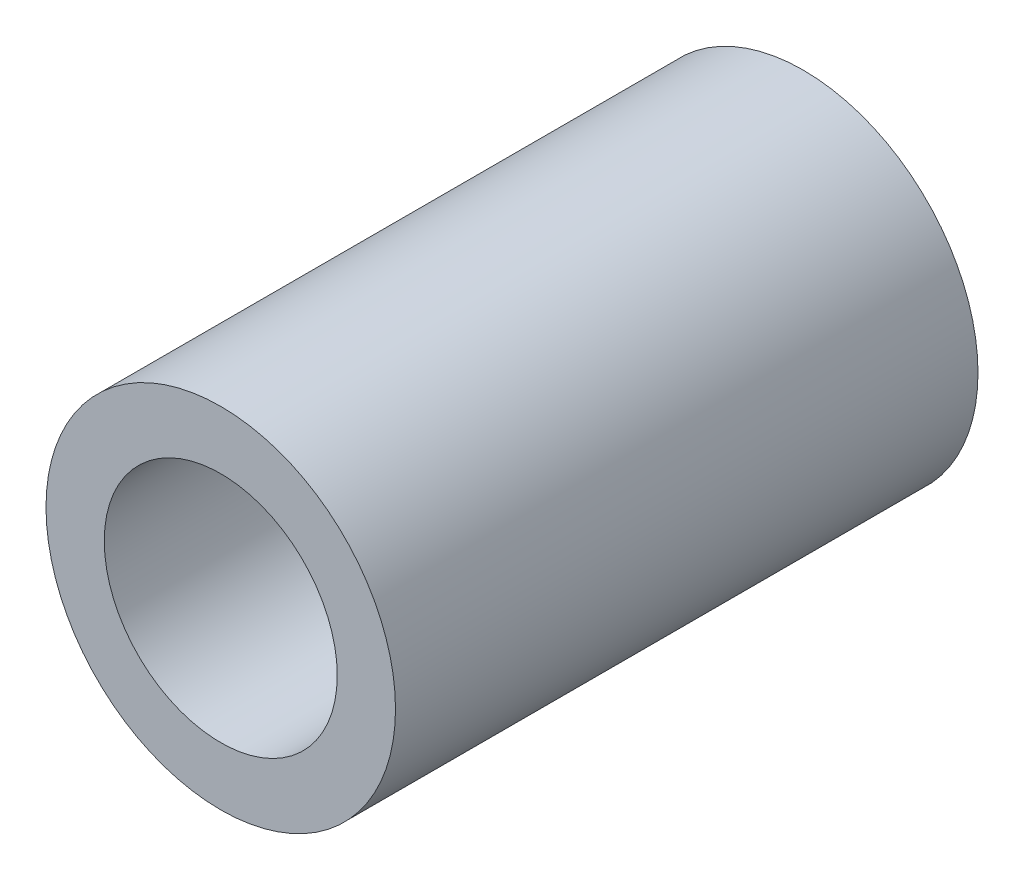
ISO-10303-21;
HEADER;
FILE_DESCRIPTION(('STEP AP214'),'2;1');
FILE_NAME('part.step','',(''),(''),'','','');
FILE_SCHEMA(('AUTOMOTIVE_DESIGN { 1 0 10303 214 1 1 1 1 }'));
ENDSEC;
DATA;
#1=APPLICATION_CONTEXT('core data for automotive mechanical design processes');
#2=APPLICATION_PROTOCOL_DEFINITION('international standard','automotive_design',2000,#1);
#3=PRODUCT_CONTEXT('',#1,'mechanical');
#4=PRODUCT('Part','Part','',(#3));
#5=PRODUCT_RELATED_PRODUCT_CATEGORY('part','',(#4));
#6=PRODUCT_DEFINITION_FORMATION('','',#4);
#7=PRODUCT_DEFINITION_CONTEXT('part definition',#1,'design');
#8=PRODUCT_DEFINITION('design','',#6,#7);
#9=PRODUCT_DEFINITION_SHAPE('','',#8);
#10=(LENGTH_UNIT() NAMED_UNIT(*) SI_UNIT(.MILLI.,.METRE.));
#11=(NAMED_UNIT(*) PLANE_ANGLE_UNIT() SI_UNIT($,.RADIAN.));
#12=(NAMED_UNIT(*) SI_UNIT($,.STERADIAN.) SOLID_ANGLE_UNIT());
#13=UNCERTAINTY_MEASURE_WITH_UNIT(LENGTH_MEASURE(1.E-05),#10,'distance_accuracy_value','');
#14=(GEOMETRIC_REPRESENTATION_CONTEXT(3) GLOBAL_UNCERTAINTY_ASSIGNED_CONTEXT((#13)) GLOBAL_UNIT_ASSIGNED_CONTEXT((#10,
#11,#12)) REPRESENTATION_CONTEXT('',''));
#15=CARTESIAN_POINT('',(0.,0.,0.));
#16=DIRECTION('',(0.,0.,1.));
#17=DIRECTION('',(1.,0.,0.));
#18=AXIS2_PLACEMENT_3D('',#15,#16,#17);
#19=CARTESIAN_POINT('',(0.,0.,15.));
#20=DIRECTION('',(0.,0.,1.));
#21=DIRECTION('',(1.,0.,0.));
#22=AXIS2_PLACEMENT_3D('',#19,#20,#21);
#23=PLANE('',#22);
#24=CARTESIAN_POINT('',(0.,0.,15.));
#25=DIRECTION('',(0.,0.,1.));
#26=DIRECTION('',(1.,0.,0.));
#27=AXIS2_PLACEMENT_3D('',#24,#25,#26);
#28=CIRCLE('',#27,4.5);
#29=CARTESIAN_POINT('',(4.5,0.,15.));
#30=VERTEX_POINT('',#29);
#31=EDGE_CURVE('E11',#30,#30,#28,.T.);
#32=ORIENTED_EDGE('',*,*,#31,.T.);
#33=EDGE_LOOP('',(#32));
#34=FACE_BOUND('',#33,.T.);
#35=CARTESIAN_POINT('',(0.,0.,15.));
#36=DIRECTION('',(0.,0.,1.));
#37=DIRECTION('',(1.,0.,0.));
#38=AXIS2_PLACEMENT_3D('',#35,#36,#37);
#39=CIRCLE('',#38,3.);
#40=CARTESIAN_POINT('',(3.,0.,15.));
#41=VERTEX_POINT('',#40);
#42=EDGE_CURVE('E60',#41,#41,#39,.T.);
#43=ORIENTED_EDGE('',*,*,#42,.F.);
#44=EDGE_LOOP('',(#43));
#45=FACE_BOUND('',#44,.T.);
#46=ADVANCED_FACE('F45',(#34,#45),#23,.T.);
#47=CARTESIAN_POINT('',(0.,0.,0.));
#48=DIRECTION('',(0.,0.,1.));
#49=DIRECTION('',(1.,0.,0.));
#50=AXIS2_PLACEMENT_3D('',#47,#48,#49);
#51=PLANE('',#50);
#52=CARTESIAN_POINT('',(0.,0.,0.));
#53=DIRECTION('',(0.,0.,1.));
#54=DIRECTION('',(1.,0.,0.));
#55=AXIS2_PLACEMENT_3D('',#52,#53,#54);
#56=CIRCLE('',#55,4.5);
#57=CARTESIAN_POINT('',(4.5,0.,0.));
#58=VERTEX_POINT('',#57);
#59=EDGE_CURVE('E49',#58,#58,#56,.T.);
#60=ORIENTED_EDGE('',*,*,#59,.F.);
#61=EDGE_LOOP('',(#60));
#62=FACE_BOUND('',#61,.T.);
#63=CARTESIAN_POINT('',(0.,0.,0.));
#64=DIRECTION('',(0.,0.,1.));
#65=DIRECTION('',(1.,0.,0.));
#66=AXIS2_PLACEMENT_3D('',#63,#64,#65);
#67=CIRCLE('',#66,3.);
#68=CARTESIAN_POINT('',(3.,0.,0.));
#69=VERTEX_POINT('',#68);
#70=EDGE_CURVE('E62',#69,#69,#67,.T.);
#71=ORIENTED_EDGE('',*,*,#70,.T.);
#72=EDGE_LOOP('',(#71));
#73=FACE_BOUND('',#72,.T.);
#74=ADVANCED_FACE('F76',(#62,#73),#51,.F.);
#75=CARTESIAN_POINT('',(0.,0.,15.));
#76=DIRECTION('',(0.,0.,-1.));
#77=DIRECTION('',(-1.,0.,0.));
#78=AXIS2_PLACEMENT_3D('',#75,#76,#77);
#79=CYLINDRICAL_SURFACE('',#78,4.5);
#80=ORIENTED_EDGE('',*,*,#31,.F.);
#81=EDGE_LOOP('',(#80));
#82=FACE_BOUND('',#81,.T.);
#83=ORIENTED_EDGE('',*,*,#59,.T.);
#84=EDGE_LOOP('',(#83));
#85=FACE_BOUND('',#84,.T.);
#86=ADVANCED_FACE('F47',(#82,#85),#79,.T.);
#87=CARTESIAN_POINT('',(0.,0.,15.));
#88=DIRECTION('',(0.,0.,-1.));
#89=DIRECTION('',(-1.,0.,0.));
#90=AXIS2_PLACEMENT_3D('',#87,#88,#89);
#91=CYLINDRICAL_SURFACE('',#90,3.);
#92=ORIENTED_EDGE('',*,*,#42,.T.);
#93=EDGE_LOOP('',(#92));
#94=FACE_BOUND('',#93,.T.);
#95=ORIENTED_EDGE('',*,*,#70,.F.);
#96=EDGE_LOOP('',(#95));
#97=FACE_BOUND('',#96,.T.);
#98=ADVANCED_FACE('F72',(#94,#97),#91,.F.);
#99=CLOSED_SHELL('',(#46,#74,#86,#98));
#100=MANIFOLD_SOLID_BREP('B2',#99);
#101=ADVANCED_BREP_SHAPE_REPRESENTATION('',(#18,#100),#14);
#102=SHAPE_DEFINITION_REPRESENTATION(#9,#101);
ENDSEC;
END-ISO-10303-21;
